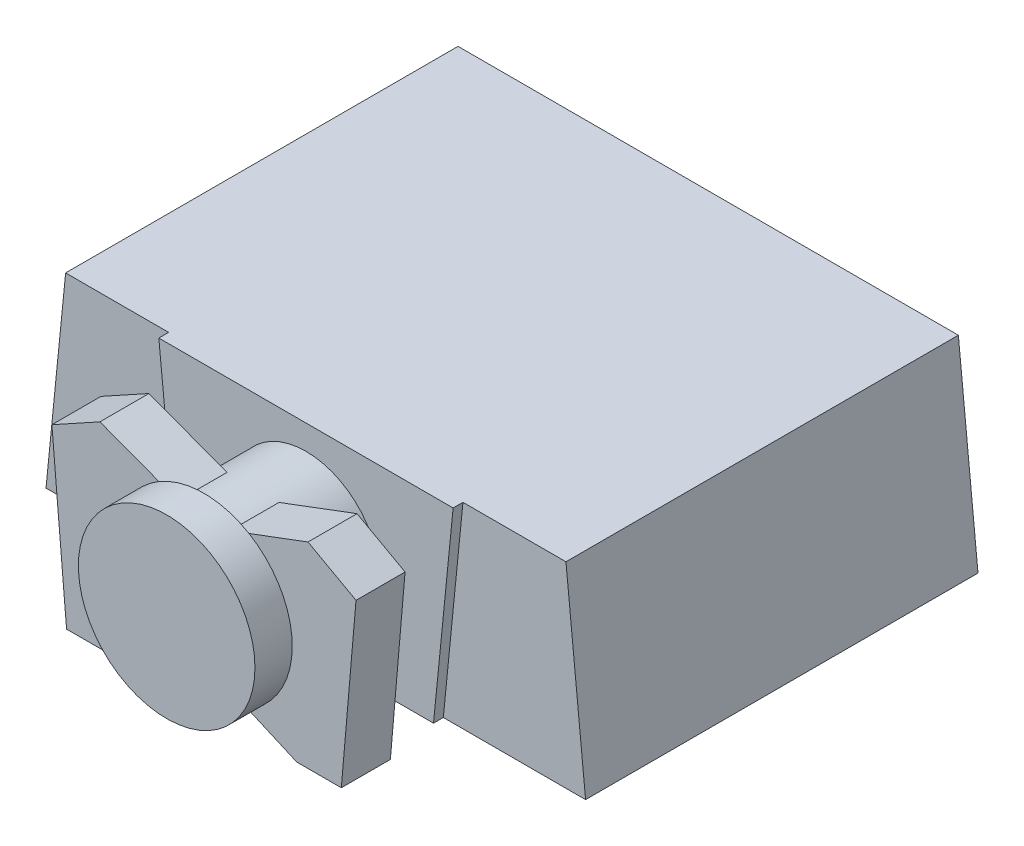
ISO-10303-21;
HEADER;
FILE_DESCRIPTION(('STEP AP214'),'2;1');
FILE_NAME('part.step','',(''),(''),'','','');
FILE_SCHEMA(('AUTOMOTIVE_DESIGN { 1 0 10303 214 1 1 1 1 }'));
ENDSEC;
DATA;
#1=APPLICATION_CONTEXT('core data for automotive mechanical design processes');
#2=APPLICATION_PROTOCOL_DEFINITION('international standard','automotive_design',2000,#1);
#3=PRODUCT_CONTEXT('',#1,'mechanical');
#4=PRODUCT('Part','Part','',(#3));
#5=PRODUCT_RELATED_PRODUCT_CATEGORY('part','',(#4));
#6=PRODUCT_DEFINITION_FORMATION('','',#4);
#7=PRODUCT_DEFINITION_CONTEXT('part definition',#1,'design');
#8=PRODUCT_DEFINITION('design','',#6,#7);
#9=PRODUCT_DEFINITION_SHAPE('','',#8);
#10=(LENGTH_UNIT() NAMED_UNIT(*) SI_UNIT(.MILLI.,.METRE.));
#11=(NAMED_UNIT(*) PLANE_ANGLE_UNIT() SI_UNIT($,.RADIAN.));
#12=(NAMED_UNIT(*) SI_UNIT($,.STERADIAN.) SOLID_ANGLE_UNIT());
#13=UNCERTAINTY_MEASURE_WITH_UNIT(LENGTH_MEASURE(1.E-05),#10,'distance_accuracy_value','');
#14=(GEOMETRIC_REPRESENTATION_CONTEXT(3) GLOBAL_UNCERTAINTY_ASSIGNED_CONTEXT((#13)) GLOBAL_UNIT_ASSIGNED_CONTEXT((#10,
#11,#12)) REPRESENTATION_CONTEXT('',''));
#15=CARTESIAN_POINT('',(0.,0.,0.));
#16=DIRECTION('',(0.,0.,1.));
#17=DIRECTION('',(1.,0.,0.));
#18=AXIS2_PLACEMENT_3D('',#15,#16,#17);
#19=CARTESIAN_POINT('',(0.,0.,57.));
#20=DIRECTION('',(0.,0.,1.));
#21=DIRECTION('',(1.,0.,0.));
#22=AXIS2_PLACEMENT_3D('',#19,#20,#21);
#23=PLANE('',#22);
#24=CARTESIAN_POINT('',(0.,0.,57.));
#25=DIRECTION('',(0.,0.,1.));
#26=DIRECTION('',(1.,0.,0.));
#27=AXIS2_PLACEMENT_3D('',#24,#25,#26);
#28=CIRCLE('',#27,45.);
#29=CARTESIAN_POINT('',(-22.9458905748051,38.710284237255,57.));
#30=VERTEX_POINT('',#29);
#31=CARTESIAN_POINT('',(-22.3462395669349,-39.0595132741967,57.));
#32=VERTEX_POINT('',#31);
#33=EDGE_CURVE('E11',#30,#32,#28,.T.);
#34=ORIENTED_EDGE('',*,*,#33,.F.);
#35=DIRECTION('',(-0.936220665654062,0.351412670804947,0.));
#36=VECTOR('',#35,1.);
#37=CARTESIAN_POINT('',(9.90206806938473,26.3807242295394,57.));
#38=LINE('',#37,#36);
#39=CARTESIAN_POINT('',(-53.0235345659322,50.,57.));
#40=VERTEX_POINT('',#39);
#41=EDGE_CURVE('E265',#30,#40,#38,.T.);
#42=ORIENTED_EDGE('',*,*,#41,.T.);
#43=DIRECTION('',(-0.875522034199031,-0.483178194491423,0.));
#44=VECTOR('',#43,1.);
#45=CARTESIAN_POINT('',(-33.5305940778251,60.7576547733478,57.));
#46=LINE('',#45,#44);
#47=CARTESIAN_POINT('',(-77.5,36.4920654032607,57.));
#48=VERTEX_POINT('',#47);
#49=EDGE_CURVE('E264',#40,#48,#46,.T.);
#50=ORIENTED_EDGE('',*,*,#49,.T.);
#51=DIRECTION('',(0.0862102539892259,-0.996276965560839,0.));
#52=VECTOR('',#51,1.);
#53=CARTESIAN_POINT('',(-73.7897262912551,-6.38520337743982,57.));
#54=LINE('',#53,#52);
#55=CARTESIAN_POINT('',(-70.0156325156325,-50.,57.));
#56=VERTEX_POINT('',#55);
#57=EDGE_CURVE('E268',#48,#56,#54,.T.);
#58=ORIENTED_EDGE('',*,*,#57,.T.);
#59=DIRECTION('',(-1.,0.,0.));
#60=VECTOR('',#59,1.);
#61=CARTESIAN_POINT('',(0.,-50.,57.));
#62=LINE('',#61,#60);
#63=CARTESIAN_POINT('',(-47.2912605588044,-50.,57.));
#64=VERTEX_POINT('',#63);
#65=EDGE_CURVE('E235',#64,#56,#62,.T.);
#66=ORIENTED_EDGE('',*,*,#65,.F.);
#67=DIRECTION('',(0.915792421439861,0.401651890115453,0.));
#68=VECTOR('',#67,1.);
#69=CARTESIAN_POINT('',(10.7622611435367,-24.5386550775961,57.));
#70=LINE('',#69,#68);
#71=EDGE_CURVE('E241',#64,#32,#70,.T.);
#72=ORIENTED_EDGE('',*,*,#71,.T.);
#73=EDGE_LOOP('',(#34,#42,#50,#58,#66,#72));
#74=FACE_BOUND('',#73,.T.);
#75=ADVANCED_FACE('F43',(#74),#23,.T.);
#76=CARTESIAN_POINT('',(0.,0.,0.));
#77=DIRECTION('',(0.,0.,1.));
#78=DIRECTION('',(1.,0.,0.));
#79=AXIS2_PLACEMENT_3D('',#76,#77,#78);
#80=PLANE('',#79);
#81=DIRECTION('',(1.,0.,0.));
#82=VECTOR('',#81,1.);
#83=CARTESIAN_POINT('',(0.,50.,0.));
#84=LINE('',#83,#82);
#85=CARTESIAN_POINT('',(75.,50.,0.));
#86=VERTEX_POINT('',#85);
#87=CARTESIAN_POINT('',(127.5,50.,0.));
#88=VERTEX_POINT('',#87);
#89=EDGE_CURVE('E415',#86,#88,#84,.T.);
#90=ORIENTED_EDGE('',*,*,#89,.F.);
#91=DIRECTION('',(-0.0995037190209989,-0.995037190209989,0.));
#92=VECTOR('',#91,1.);
#93=CARTESIAN_POINT('',(75.,50.,0.));
#94=LINE('',#93,#92);
#95=CARTESIAN_POINT('',(65.,-50.,0.));
#96=VERTEX_POINT('',#95);
#97=EDGE_CURVE('E373',#86,#96,#94,.T.);
#98=ORIENTED_EDGE('',*,*,#97,.T.);
#99=DIRECTION('',(1.,0.,0.));
#100=VECTOR('',#99,1.);
#101=CARTESIAN_POINT('',(0.,-50.,0.));
#102=LINE('',#101,#100);
#103=CARTESIAN_POINT('',(137.5,-50.,0.));
#104=VERTEX_POINT('',#103);
#105=EDGE_CURVE('E383',#96,#104,#102,.T.);
#106=ORIENTED_EDGE('',*,*,#105,.T.);
#107=DIRECTION('',(-0.0995037190209993,0.995037190209989,0.));
#108=VECTOR('',#107,1.);
#109=CARTESIAN_POINT('',(131.188118811881,13.1188118811882,0.));
#110=LINE('',#109,#108);
#111=EDGE_CURVE('E411',#104,#88,#110,.T.);
#112=ORIENTED_EDGE('',*,*,#111,.T.);
#113=EDGE_LOOP('',(#90,#98,#106,#112));
#114=FACE_BOUND('',#113,.T.);
#115=ADVANCED_FACE('F443',(#114),#80,.T.);
#116=CARTESIAN_POINT('',(-137.5,-50.0000000000001,0.));
#117=VERTEX_POINT('',#116);
#118=CARTESIAN_POINT('',(-65.,-50.,0.));
#119=VERTEX_POINT('',#118);
#120=EDGE_CURVE('E407',#117,#119,#102,.T.);
#121=ORIENTED_EDGE('',*,*,#120,.T.);
#122=DIRECTION('',(-0.0995037190209986,0.995037190209989,0.));
#123=VECTOR('',#122,1.);
#124=CARTESIAN_POINT('',(-75.,50.0000000000001,0.));
#125=LINE('',#124,#123);
#126=CARTESIAN_POINT('',(-75.,50.,0.));
#127=VERTEX_POINT('',#126);
#128=EDGE_CURVE('E360',#119,#127,#125,.T.);
#129=ORIENTED_EDGE('',*,*,#128,.T.);
#130=CARTESIAN_POINT('',(-127.5,50.,0.));
#131=VERTEX_POINT('',#130);
#132=EDGE_CURVE('E416',#131,#127,#84,.T.);
#133=ORIENTED_EDGE('',*,*,#132,.F.);
#134=DIRECTION('',(0.0995037190209987,0.995037190209989,0.));
#135=VECTOR('',#134,1.);
#136=CARTESIAN_POINT('',(-131.188118811881,13.1188118811881,0.));
#137=LINE('',#136,#135);
#138=EDGE_CURVE('E397',#117,#131,#137,.T.);
#139=ORIENTED_EDGE('',*,*,#138,.F.);
#140=EDGE_LOOP('',(#121,#129,#133,#139));
#141=FACE_BOUND('',#140,.T.);
#142=ADVANCED_FACE('F506',(#141),#80,.T.);
#143=CARTESIAN_POINT('',(0.,-50.,-200.));
#144=DIRECTION('',(0.,-1.,0.));
#145=DIRECTION('',(1.,0.,0.));
#146=AXIS2_PLACEMENT_3D('',#143,#144,#145);
#147=PLANE('',#146);
#148=ORIENTED_EDGE('',*,*,#120,.F.);
#149=DIRECTION('',(0.,0.,1.));
#150=VECTOR('',#149,1.);
#151=CARTESIAN_POINT('',(-137.5,-50.0000000000001,-200.));
#152=LINE('',#151,#150);
#153=CARTESIAN_POINT('',(-137.5,-50.0000000000001,-200.));
#154=VERTEX_POINT('',#153);
#155=EDGE_CURVE('E354',#154,#117,#152,.T.);
#156=ORIENTED_EDGE('',*,*,#155,.F.);
#157=DIRECTION('',(1.,0.,0.));
#158=VECTOR('',#157,1.);
#159=CARTESIAN_POINT('',(0.,-50.,-200.));
#160=LINE('',#159,#158);
#161=CARTESIAN_POINT('',(137.5,-50.,-200.));
#162=VERTEX_POINT('',#161);
#163=EDGE_CURVE('E392',#154,#162,#160,.T.);
#164=ORIENTED_EDGE('',*,*,#163,.T.);
#165=DIRECTION('',(0.,0.,1.));
#166=VECTOR('',#165,1.);
#167=CARTESIAN_POINT('',(137.5,-50.,-200.));
#168=LINE('',#167,#166);
#169=EDGE_CURVE('E47',#162,#104,#168,.T.);
#170=ORIENTED_EDGE('',*,*,#169,.T.);
#171=ORIENTED_EDGE('',*,*,#105,.F.);
#172=DIRECTION('',(0.,0.,-1.));
#173=VECTOR('',#172,1.);
#174=CARTESIAN_POINT('',(65.,-50.,5.));
#175=LINE('',#174,#173);
#176=CARTESIAN_POINT('',(65.,-50.,5.));
#177=VERTEX_POINT('',#176);
#178=EDGE_CURVE('E387',#177,#96,#175,.T.);
#179=ORIENTED_EDGE('',*,*,#178,.F.);
#180=DIRECTION('',(-1.,0.,0.));
#181=VECTOR('',#180,1.);
#182=CARTESIAN_POINT('',(65.,-50.,5.));
#183=LINE('',#182,#181);
#184=CARTESIAN_POINT('',(-65.,-50.,5.));
#185=VERTEX_POINT('',#184);
#186=EDGE_CURVE('E364',#177,#185,#183,.T.);
#187=ORIENTED_EDGE('',*,*,#186,.T.);
#188=DIRECTION('',(0.,0.,-1.));
#189=VECTOR('',#188,1.);
#190=CARTESIAN_POINT('',(-65.,-50.,5.));
#191=LINE('',#190,#189);
#192=EDGE_CURVE('E384',#185,#119,#191,.T.);
#193=ORIENTED_EDGE('',*,*,#192,.T.);
#194=EDGE_LOOP('',(#148,#156,#164,#170,#171,#179,#187,#193));
#195=FACE_BOUND('',#194,.T.);
#196=ADVANCED_FACE('F45',(#195),#147,.T.);
#197=CARTESIAN_POINT('',(-131.188118811881,13.1188118811881,-200.));
#198=DIRECTION('',(0.995037190209989,-0.0995037190209987,0.));
#199=DIRECTION('',(0.0995037190209987,0.995037190209989,0.));
#200=AXIS2_PLACEMENT_3D('',#197,#198,#199);
#201=PLANE('',#200);
#202=ORIENTED_EDGE('',*,*,#138,.T.);
#203=DIRECTION('',(0.,0.,1.));
#204=VECTOR('',#203,1.);
#205=CARTESIAN_POINT('',(-127.5,50.,-200.));
#206=LINE('',#205,#204);
#207=CARTESIAN_POINT('',(-127.5,50.,-200.));
#208=VERTEX_POINT('',#207);
#209=EDGE_CURVE('E424',#208,#131,#206,.T.);
#210=ORIENTED_EDGE('',*,*,#209,.F.);
#211=DIRECTION('',(0.0995037190209987,0.995037190209989,0.));
#212=VECTOR('',#211,1.);
#213=CARTESIAN_POINT('',(-131.188118811881,13.1188118811881,-200.));
#214=LINE('',#213,#212);
#215=EDGE_CURVE('E404',#154,#208,#214,.T.);
#216=ORIENTED_EDGE('',*,*,#215,.F.);
#217=ORIENTED_EDGE('',*,*,#155,.T.);
#218=EDGE_LOOP('',(#202,#210,#216,#217));
#219=FACE_BOUND('',#218,.T.);
#220=ADVANCED_FACE('F664',(#219),#201,.F.);
#221=CARTESIAN_POINT('',(0.,50.,-200.));
#222=DIRECTION('',(0.,-1.,0.));
#223=DIRECTION('',(1.,0.,0.));
#224=AXIS2_PLACEMENT_3D('',#221,#222,#223);
#225=PLANE('',#224);
#226=ORIENTED_EDGE('',*,*,#132,.T.);
#227=DIRECTION('',(0.,0.,-1.));
#228=VECTOR('',#227,1.);
#229=CARTESIAN_POINT('',(-75.,50.0000000000001,5.));
#230=LINE('',#229,#228);
#231=CARTESIAN_POINT('',(-75.,50.0000000000001,5.));
#232=VERTEX_POINT('',#231);
#233=EDGE_CURVE('E380',#232,#127,#230,.T.);
#234=ORIENTED_EDGE('',*,*,#233,.F.);
#235=DIRECTION('',(1.,0.,0.));
#236=VECTOR('',#235,1.);
#237=CARTESIAN_POINT('',(75.,50.,5.));
#238=LINE('',#237,#236);
#239=CARTESIAN_POINT('',(75.,50.,5.));
#240=VERTEX_POINT('',#239);
#241=EDGE_CURVE('E355',#232,#240,#238,.T.);
#242=ORIENTED_EDGE('',*,*,#241,.T.);
#243=DIRECTION('',(0.,0.,-1.));
#244=VECTOR('',#243,1.);
#245=CARTESIAN_POINT('',(75.,50.,5.));
#246=LINE('',#245,#244);
#247=EDGE_CURVE('E372',#240,#86,#246,.T.);
#248=ORIENTED_EDGE('',*,*,#247,.T.);
#249=ORIENTED_EDGE('',*,*,#89,.T.);
#250=DIRECTION('',(0.,0.,1.));
#251=VECTOR('',#250,1.);
#252=CARTESIAN_POINT('',(127.5,50.,-200.));
#253=LINE('',#252,#251);
#254=CARTESIAN_POINT('',(127.5,50.,-200.));
#255=VERTEX_POINT('',#254);
#256=EDGE_CURVE('E427',#255,#88,#253,.T.);
#257=ORIENTED_EDGE('',*,*,#256,.F.);
#258=DIRECTION('',(1.,0.,0.));
#259=VECTOR('',#258,1.);
#260=CARTESIAN_POINT('',(0.,50.,-200.));
#261=LINE('',#260,#259);
#262=EDGE_CURVE('E401',#208,#255,#261,.T.);
#263=ORIENTED_EDGE('',*,*,#262,.F.);
#264=ORIENTED_EDGE('',*,*,#209,.T.);
#265=EDGE_LOOP('',(#226,#234,#242,#248,#249,#257,#263,#264));
#266=FACE_BOUND('',#265,.T.);
#267=ADVANCED_FACE('F660',(#266),#225,.F.);
#268=CARTESIAN_POINT('',(131.188118811881,13.1188118811882,-200.));
#269=DIRECTION('',(0.995037190209989,0.0995037190209992,0.));
#270=DIRECTION('',(-0.0995037190209992,0.995037190209989,0.));
#271=AXIS2_PLACEMENT_3D('',#268,#269,#270);
#272=PLANE('',#271);
#273=ORIENTED_EDGE('',*,*,#111,.F.);
#274=ORIENTED_EDGE('',*,*,#169,.F.);
#275=DIRECTION('',(-0.0995037190209993,0.995037190209989,0.));
#276=VECTOR('',#275,1.);
#277=CARTESIAN_POINT('',(131.188118811881,13.1188118811882,-200.));
#278=LINE('',#277,#276);
#279=EDGE_CURVE('E396',#162,#255,#278,.T.);
#280=ORIENTED_EDGE('',*,*,#279,.T.);
#281=ORIENTED_EDGE('',*,*,#256,.T.);
#282=EDGE_LOOP('',(#273,#274,#280,#281));
#283=FACE_BOUND('',#282,.T.);
#284=ADVANCED_FACE('F440',(#283),#272,.T.);
#285=CARTESIAN_POINT('',(0.,0.,-200.));
#286=DIRECTION('',(0.,0.,1.));
#287=DIRECTION('',(1.,0.,0.));
#288=AXIS2_PLACEMENT_3D('',#285,#286,#287);
#289=PLANE('',#288);
#290=ORIENTED_EDGE('',*,*,#163,.F.);
#291=ORIENTED_EDGE('',*,*,#215,.T.);
#292=ORIENTED_EDGE('',*,*,#262,.T.);
#293=ORIENTED_EDGE('',*,*,#279,.F.);
#294=EDGE_LOOP('',(#290,#291,#292,#293));
#295=FACE_BOUND('',#294,.T.);
#296=ADVANCED_FACE('F652',(#295),#289,.F.);
#297=CARTESIAN_POINT('',(-75.,50.0000000000001,5.));
#298=DIRECTION('',(-0.995037190209989,-0.0995037190209986,0.));
#299=DIRECTION('',(0.0995037190209986,-0.995037190209989,0.));
#300=AXIS2_PLACEMENT_3D('',#297,#298,#299);
#301=PLANE('',#300);
#302=ORIENTED_EDGE('',*,*,#128,.F.);
#303=ORIENTED_EDGE('',*,*,#192,.F.);
#304=DIRECTION('',(-0.0995037190209986,0.995037190209989,0.));
#305=VECTOR('',#304,1.);
#306=CARTESIAN_POINT('',(-75.,50.0000000000001,5.));
#307=LINE('',#306,#305);
#308=EDGE_CURVE('E368',#185,#232,#307,.T.);
#309=ORIENTED_EDGE('',*,*,#308,.T.);
#310=ORIENTED_EDGE('',*,*,#233,.T.);
#311=EDGE_LOOP('',(#302,#303,#309,#310));
#312=FACE_BOUND('',#311,.T.);
#313=ADVANCED_FACE('F642',(#312),#301,.T.);
#314=CARTESIAN_POINT('',(75.,50.,5.));
#315=DIRECTION('',(0.995037190209989,-0.0995037190209989,0.));
#316=DIRECTION('',(0.0995037190209989,0.995037190209989,0.));
#317=AXIS2_PLACEMENT_3D('',#314,#315,#316);
#318=PLANE('',#317);
#319=ORIENTED_EDGE('',*,*,#97,.F.);
#320=ORIENTED_EDGE('',*,*,#247,.F.);
#321=DIRECTION('',(-0.0995037190209989,-0.995037190209989,0.));
#322=VECTOR('',#321,1.);
#323=CARTESIAN_POINT('',(75.,50.,5.));
#324=LINE('',#323,#322);
#325=EDGE_CURVE('E359',#240,#177,#324,.T.);
#326=ORIENTED_EDGE('',*,*,#325,.T.);
#327=ORIENTED_EDGE('',*,*,#178,.T.);
#328=EDGE_LOOP('',(#319,#320,#326,#327));
#329=FACE_BOUND('',#328,.T.);
#330=ADVANCED_FACE('F631',(#329),#318,.T.);
#331=CARTESIAN_POINT('',(0.,0.,5.));
#332=DIRECTION('',(0.,0.,1.));
#333=DIRECTION('',(1.,0.,0.));
#334=AXIS2_PLACEMENT_3D('',#331,#332,#333);
#335=PLANE('',#334);
#336=CARTESIAN_POINT('',(0.,0.,5.));
#337=DIRECTION('',(0.,0.,1.));
#338=DIRECTION('',(1.,0.,0.));
#339=AXIS2_PLACEMENT_3D('',#336,#337,#338);
#340=CIRCLE('',#339,37.5);
#341=CARTESIAN_POINT('',(37.5,0.,5.));
#342=VERTEX_POINT('',#341);
#343=EDGE_CURVE('E222',#342,#342,#340,.T.);
#344=ORIENTED_EDGE('',*,*,#343,.F.);
#345=EDGE_LOOP('',(#344));
#346=FACE_BOUND('',#345,.T.);
#347=ORIENTED_EDGE('',*,*,#241,.F.);
#348=ORIENTED_EDGE('',*,*,#308,.F.);
#349=ORIENTED_EDGE('',*,*,#186,.F.);
#350=ORIENTED_EDGE('',*,*,#325,.F.);
#351=EDGE_LOOP('',(#347,#348,#349,#350));
#352=FACE_BOUND('',#351,.T.);
#353=ADVANCED_FACE('F558',(#346,#352),#335,.T.);
#354=CARTESIAN_POINT('',(0.,0.,32.));
#355=DIRECTION('',(0.,0.,-1.));
#356=DIRECTION('',(-1.,0.,0.));
#357=AXIS2_PLACEMENT_3D('',#354,#355,#356);
#358=CYLINDRICAL_SURFACE('',#357,37.5);
#359=CARTESIAN_POINT('',(0.,0.,32.));
#360=DIRECTION('',(0.,0.,1.));
#361=DIRECTION('',(1.,0.,0.));
#362=AXIS2_PLACEMENT_3D('',#359,#360,#361);
#363=CIRCLE('',#362,37.5);
#364=CARTESIAN_POINT('',(-13.2636039462143,35.0760147445226,32.));
#365=VERTEX_POINT('',#364);
#366=CARTESIAN_POINT('',(-13.2636039462143,-35.0760147445226,32.));
#367=VERTEX_POINT('',#366);
#368=EDGE_CURVE('E350',#365,#367,#363,.T.);
#369=ORIENTED_EDGE('',*,*,#368,.F.);
#370=DIRECTION('',(0.,0.,-1.));
#371=VECTOR('',#370,1.);
#372=CARTESIAN_POINT('',(-13.2636039462143,35.0760147445226,57.));
#373=LINE('',#372,#371);
#374=CARTESIAN_POINT('',(-13.2636039462143,35.0760147445226,57.));
#375=VERTEX_POINT('',#374);
#376=EDGE_CURVE('E318',#375,#365,#373,.T.);
#377=ORIENTED_EDGE('',*,*,#376,.F.);
#378=CARTESIAN_POINT('',(0.,0.,57.));
#379=DIRECTION('',(0.,0.,1.));
#380=DIRECTION('',(1.,0.,0.));
#381=AXIS2_PLACEMENT_3D('',#378,#379,#380);
#382=CIRCLE('',#381,37.5);
#383=CARTESIAN_POINT('',(13.2636039462143,35.0760147445226,57.));
#384=VERTEX_POINT('',#383);
#385=EDGE_CURVE('E207',#384,#375,#382,.T.);
#386=ORIENTED_EDGE('',*,*,#385,.F.);
#387=DIRECTION('',(0.,0.,-1.));
#388=VECTOR('',#387,1.);
#389=CARTESIAN_POINT('',(13.2636039462143,35.0760147445226,57.));
#390=LINE('',#389,#388);
#391=CARTESIAN_POINT('',(13.2636039462143,35.0760147445226,32.));
#392=VERTEX_POINT('',#391);
#393=EDGE_CURVE('E201',#384,#392,#390,.T.);
#394=ORIENTED_EDGE('',*,*,#393,.T.);
#395=CARTESIAN_POINT('',(13.2636039462144,-35.0760147445226,32.));
#396=VERTEX_POINT('',#395);
#397=EDGE_CURVE('E347',#396,#392,#363,.T.);
#398=ORIENTED_EDGE('',*,*,#397,.F.);
#399=DIRECTION('',(0.,0.,-1.));
#400=VECTOR('',#399,1.);
#401=CARTESIAN_POINT('',(13.2636039462144,-35.0760147445226,57.));
#402=LINE('',#401,#400);
#403=CARTESIAN_POINT('',(13.2636039462144,-35.0760147445226,57.));
#404=VERTEX_POINT('',#403);
#405=EDGE_CURVE('E336',#404,#396,#402,.T.);
#406=ORIENTED_EDGE('',*,*,#405,.F.);
#407=CARTESIAN_POINT('',(-13.2636039462143,-35.0760147445226,57.));
#408=VERTEX_POINT('',#407);
#409=EDGE_CURVE('E244',#408,#404,#382,.T.);
#410=ORIENTED_EDGE('',*,*,#409,.F.);
#411=DIRECTION('',(0.,0.,-1.));
#412=VECTOR('',#411,1.);
#413=CARTESIAN_POINT('',(-13.2636039462143,-35.0760147445226,57.));
#414=LINE('',#413,#412);
#415=EDGE_CURVE('E340',#408,#367,#414,.T.);
#416=ORIENTED_EDGE('',*,*,#415,.T.);
#417=EDGE_LOOP('',(#369,#377,#386,#394,#398,#406,#410,#416));
#418=FACE_BOUND('',#417,.T.);
#419=ORIENTED_EDGE('',*,*,#343,.T.);
#420=EDGE_LOOP('',(#419));
#421=FACE_BOUND('',#420,.T.);
#422=ADVANCED_FACE('F472',(#418,#421),#358,.T.);
#423=CARTESIAN_POINT('',(0.,0.,32.));
#424=DIRECTION('',(0.,0.,1.));
#425=DIRECTION('',(1.,0.,0.));
#426=AXIS2_PLACEMENT_3D('',#423,#424,#425);
#427=PLANE('',#426);
#428=DIRECTION('',(-0.936220665654062,0.351412670804947,0.));
#429=VECTOR('',#428,1.);
#430=CARTESIAN_POINT('',(9.90206806938473,26.3807242295394,32.));
#431=LINE('',#430,#429);
#432=CARTESIAN_POINT('',(-53.0235345659322,50.,32.));
#433=VERTEX_POINT('',#432);
#434=EDGE_CURVE('E299',#365,#433,#431,.T.);
#435=ORIENTED_EDGE('',*,*,#434,.F.);
#436=ORIENTED_EDGE('',*,*,#368,.T.);
#437=DIRECTION('',(0.915792421439861,0.401651890115453,0.));
#438=VECTOR('',#437,1.);
#439=CARTESIAN_POINT('',(10.7622611435367,-24.5386550775961,32.));
#440=LINE('',#439,#438);
#441=CARTESIAN_POINT('',(-47.2912605588044,-50.,32.));
#442=VERTEX_POINT('',#441);
#443=EDGE_CURVE('E275',#442,#367,#440,.T.);
#444=ORIENTED_EDGE('',*,*,#443,.F.);
#445=DIRECTION('',(-1.,0.,0.));
#446=VECTOR('',#445,1.);
#447=CARTESIAN_POINT('',(0.,-50.,32.));
#448=LINE('',#447,#446);
#449=CARTESIAN_POINT('',(-70.0156325156325,-50.,32.));
#450=VERTEX_POINT('',#449);
#451=EDGE_CURVE('E232',#442,#450,#448,.T.);
#452=ORIENTED_EDGE('',*,*,#451,.T.);
#453=DIRECTION('',(0.0862102539892259,-0.996276965560839,0.));
#454=VECTOR('',#453,1.);
#455=CARTESIAN_POINT('',(-73.7897262912551,-6.38520337743982,32.));
#456=LINE('',#455,#454);
#457=CARTESIAN_POINT('',(-77.5,36.4920654032607,32.));
#458=VERTEX_POINT('',#457);
#459=EDGE_CURVE('E240',#458,#450,#456,.T.);
#460=ORIENTED_EDGE('',*,*,#459,.F.);
#461=DIRECTION('',(-0.875522034199031,-0.483178194491423,0.));
#462=VECTOR('',#461,1.);
#463=CARTESIAN_POINT('',(-33.5305940778251,60.7576547733478,32.));
#464=LINE('',#463,#462);
#465=EDGE_CURVE('E302',#433,#458,#464,.T.);
#466=ORIENTED_EDGE('',*,*,#465,.F.);
#467=EDGE_LOOP('',(#435,#436,#444,#452,#460,#466));
#468=FACE_BOUND('',#467,.T.);
#469=ADVANCED_FACE('F468',(#468),#427,.F.);
#470=DIRECTION('',(-0.915792421439861,0.401651890115453,0.));
#471=VECTOR('',#470,1.);
#472=CARTESIAN_POINT('',(-10.7622611435367,-24.538655077596,32.));
#473=LINE('',#472,#471);
#474=CARTESIAN_POINT('',(47.2912605588045,-50.,32.));
#475=VERTEX_POINT('',#474);
#476=EDGE_CURVE('E279',#475,#396,#473,.T.);
#477=ORIENTED_EDGE('',*,*,#476,.T.);
#478=ORIENTED_EDGE('',*,*,#397,.T.);
#479=DIRECTION('',(0.936220665654062,0.351412670804947,0.));
#480=VECTOR('',#479,1.);
#481=CARTESIAN_POINT('',(-9.90206806938473,26.3807242295394,32.));
#482=LINE('',#481,#480);
#483=CARTESIAN_POINT('',(53.0235345659322,50.,32.));
#484=VERTEX_POINT('',#483);
#485=EDGE_CURVE('E295',#392,#484,#482,.T.);
#486=ORIENTED_EDGE('',*,*,#485,.T.);
#487=DIRECTION('',(0.875522034199031,-0.483178194491423,0.));
#488=VECTOR('',#487,1.);
#489=CARTESIAN_POINT('',(33.530594077825,60.7576547733478,32.));
#490=LINE('',#489,#488);
#491=CARTESIAN_POINT('',(77.5,36.4920654032607,32.));
#492=VERTEX_POINT('',#491);
#493=EDGE_CURVE('E291',#484,#492,#490,.T.);
#494=ORIENTED_EDGE('',*,*,#493,.T.);
#495=DIRECTION('',(-0.0862102539892256,-0.996276965560839,0.));
#496=VECTOR('',#495,1.);
#497=CARTESIAN_POINT('',(73.7897262912551,-6.3852033774398,32.));
#498=LINE('',#497,#496);
#499=CARTESIAN_POINT('',(70.0156325156325,-50.,32.));
#500=VERTEX_POINT('',#499);
#501=EDGE_CURVE('E287',#492,#500,#498,.T.);
#502=ORIENTED_EDGE('',*,*,#501,.T.);
#503=DIRECTION('',(-1.,0.,0.));
#504=VECTOR('',#503,1.);
#505=CARTESIAN_POINT('',(0.,-50.,32.));
#506=LINE('',#505,#504);
#507=EDGE_CURVE('E283',#500,#475,#506,.T.);
#508=ORIENTED_EDGE('',*,*,#507,.T.);
#509=EDGE_LOOP('',(#477,#478,#486,#494,#502,#508));
#510=FACE_BOUND('',#509,.T.);
#511=ADVANCED_FACE('F480',(#510),#427,.F.);
#512=CARTESIAN_POINT('',(0.,-50.,57.));
#513=DIRECTION('',(0.,-1.,0.));
#514=DIRECTION('',(1.,0.,0.));
#515=AXIS2_PLACEMENT_3D('',#512,#513,#514);
#516=PLANE('',#515);
#517=ORIENTED_EDGE('',*,*,#451,.F.);
#518=DIRECTION('',(0.,0.,-1.));
#519=VECTOR('',#518,1.);
#520=CARTESIAN_POINT('',(-47.2912605588044,-50.,57.));
#521=LINE('',#520,#519);
#522=EDGE_CURVE('E344',#64,#442,#521,.T.);
#523=ORIENTED_EDGE('',*,*,#522,.F.);
#524=ORIENTED_EDGE('',*,*,#65,.T.);
#525=DIRECTION('',(0.,0.,-1.));
#526=VECTOR('',#525,1.);
#527=CARTESIAN_POINT('',(-70.0156325156325,-50.,57.));
#528=LINE('',#527,#526);
#529=EDGE_CURVE('E271',#56,#450,#528,.T.);
#530=ORIENTED_EDGE('',*,*,#529,.T.);
#531=EDGE_LOOP('',(#517,#523,#524,#530));
#532=FACE_BOUND('',#531,.T.);
#533=ADVANCED_FACE('F464',(#532),#516,.T.);
#534=CARTESIAN_POINT('',(10.7622611435367,-24.5386550775961,57.));
#535=DIRECTION('',(-0.401651890115453,0.915792421439861,0.));
#536=DIRECTION('',(-0.915792421439861,-0.401651890115453,0.));
#537=AXIS2_PLACEMENT_3D('',#534,#535,#536);
#538=PLANE('',#537);
#539=ORIENTED_EDGE('',*,*,#443,.T.);
#540=ORIENTED_EDGE('',*,*,#415,.F.);
#541=EDGE_CURVE('E239',#32,#408,#70,.T.);
#542=ORIENTED_EDGE('',*,*,#541,.F.);
#543=ORIENTED_EDGE('',*,*,#71,.F.);
#544=ORIENTED_EDGE('',*,*,#522,.T.);
#545=EDGE_LOOP('',(#539,#540,#542,#543,#544));
#546=FACE_BOUND('',#545,.T.);
#547=ADVANCED_FACE('F458',(#546),#538,.F.);
#548=CARTESIAN_POINT('',(-10.7622611435367,-24.538655077596,57.));
#549=DIRECTION('',(-0.401651890115453,-0.915792421439861,0.));
#550=DIRECTION('',(0.915792421439861,-0.401651890115453,0.));
#551=AXIS2_PLACEMENT_3D('',#548,#549,#550);
#552=PLANE('',#551);
#553=ORIENTED_EDGE('',*,*,#476,.F.);
#554=DIRECTION('',(0.,0.,-1.));
#555=VECTOR('',#554,1.);
#556=CARTESIAN_POINT('',(47.2912605588045,-50.,57.));
#557=LINE('',#556,#555);
#558=CARTESIAN_POINT('',(47.2912605588045,-50.,57.));
#559=VERTEX_POINT('',#558);
#560=EDGE_CURVE('E333',#559,#475,#557,.T.);
#561=ORIENTED_EDGE('',*,*,#560,.F.);
#562=DIRECTION('',(-0.915792421439861,0.401651890115453,0.));
#563=VECTOR('',#562,1.);
#564=CARTESIAN_POINT('',(-10.7622611435367,-24.538655077596,57.));
#565=LINE('',#564,#563);
#566=CARTESIAN_POINT('',(22.346239566935,-39.0595132741967,57.));
#567=VERTEX_POINT('',#566);
#568=EDGE_CURVE('E249',#559,#567,#565,.T.);
#569=ORIENTED_EDGE('',*,*,#568,.T.);
#570=EDGE_CURVE('E248',#567,#404,#565,.T.);
#571=ORIENTED_EDGE('',*,*,#570,.T.);
#572=ORIENTED_EDGE('',*,*,#405,.T.);
#573=EDGE_LOOP('',(#553,#561,#569,#571,#572));
#574=FACE_BOUND('',#573,.T.);
#575=ADVANCED_FACE('F484',(#574),#552,.T.);
#576=CARTESIAN_POINT('',(0.,-50.,57.));
#577=DIRECTION('',(0.,-1.,0.));
#578=DIRECTION('',(1.,0.,0.));
#579=AXIS2_PLACEMENT_3D('',#576,#577,#578);
#580=PLANE('',#579);
#581=ORIENTED_EDGE('',*,*,#507,.F.);
#582=DIRECTION('',(0.,0.,-1.));
#583=VECTOR('',#582,1.);
#584=CARTESIAN_POINT('',(70.0156325156325,-50.,57.));
#585=LINE('',#584,#583);
#586=CARTESIAN_POINT('',(70.0156325156325,-50.,57.));
#587=VERTEX_POINT('',#586);
#588=EDGE_CURVE('E330',#587,#500,#585,.T.);
#589=ORIENTED_EDGE('',*,*,#588,.F.);
#590=DIRECTION('',(-1.,0.,0.));
#591=VECTOR('',#590,1.);
#592=CARTESIAN_POINT('',(0.,-50.,57.));
#593=LINE('',#592,#591);
#594=EDGE_CURVE('E252',#587,#559,#593,.T.);
#595=ORIENTED_EDGE('',*,*,#594,.T.);
#596=ORIENTED_EDGE('',*,*,#560,.T.);
#597=EDGE_LOOP('',(#581,#589,#595,#596));
#598=FACE_BOUND('',#597,.T.);
#599=ADVANCED_FACE('F487',(#598),#580,.T.);
#600=CARTESIAN_POINT('',(73.7897262912551,-6.3852033774398,57.));
#601=DIRECTION('',(0.996276965560839,-0.0862102539892256,0.));
#602=DIRECTION('',(0.0862102539892256,0.996276965560839,0.));
#603=AXIS2_PLACEMENT_3D('',#600,#601,#602);
#604=PLANE('',#603);
#605=ORIENTED_EDGE('',*,*,#501,.F.);
#606=DIRECTION('',(0.,0.,-1.));
#607=VECTOR('',#606,1.);
#608=CARTESIAN_POINT('',(77.5,36.4920654032607,57.));
#609=LINE('',#608,#607);
#610=CARTESIAN_POINT('',(77.5,36.4920654032607,57.));
#611=VERTEX_POINT('',#610);
#612=EDGE_CURVE('E327',#611,#492,#609,.T.);
#613=ORIENTED_EDGE('',*,*,#612,.F.);
#614=DIRECTION('',(-0.0862102539892256,-0.996276965560839,0.));
#615=VECTOR('',#614,1.);
#616=CARTESIAN_POINT('',(73.7897262912551,-6.3852033774398,57.));
#617=LINE('',#616,#615);
#618=EDGE_CURVE('E256',#611,#587,#617,.T.);
#619=ORIENTED_EDGE('',*,*,#618,.T.);
#620=ORIENTED_EDGE('',*,*,#588,.T.);
#621=EDGE_LOOP('',(#605,#613,#619,#620));
#622=FACE_BOUND('',#621,.T.);
#623=ADVANCED_FACE('F490',(#622),#604,.T.);
#624=CARTESIAN_POINT('',(33.530594077825,60.7576547733478,57.));
#625=DIRECTION('',(0.483178194491423,0.875522034199031,0.));
#626=DIRECTION('',(-0.875522034199031,0.483178194491423,0.));
#627=AXIS2_PLACEMENT_3D('',#624,#625,#626);
#628=PLANE('',#627);
#629=ORIENTED_EDGE('',*,*,#493,.F.);
#630=DIRECTION('',(0.,0.,-1.));
#631=VECTOR('',#630,1.);
#632=CARTESIAN_POINT('',(53.0235345659322,50.,57.));
#633=LINE('',#632,#631);
#634=CARTESIAN_POINT('',(53.0235345659322,50.,57.));
#635=VERTEX_POINT('',#634);
#636=EDGE_CURVE('E324',#635,#484,#633,.T.);
#637=ORIENTED_EDGE('',*,*,#636,.F.);
#638=DIRECTION('',(0.875522034199031,-0.483178194491423,0.));
#639=VECTOR('',#638,1.);
#640=CARTESIAN_POINT('',(33.530594077825,60.7576547733478,57.));
#641=LINE('',#640,#639);
#642=EDGE_CURVE('E213',#635,#611,#641,.T.);
#643=ORIENTED_EDGE('',*,*,#642,.T.);
#644=ORIENTED_EDGE('',*,*,#612,.T.);
#645=EDGE_LOOP('',(#629,#637,#643,#644));
#646=FACE_BOUND('',#645,.T.);
#647=ADVANCED_FACE('F492',(#646),#628,.T.);
#648=CARTESIAN_POINT('',(-9.90206806938473,26.3807242295394,57.));
#649=DIRECTION('',(-0.351412670804947,0.936220665654062,0.));
#650=DIRECTION('',(-0.936220665654062,-0.351412670804947,0.));
#651=AXIS2_PLACEMENT_3D('',#648,#649,#650);
#652=PLANE('',#651);
#653=ORIENTED_EDGE('',*,*,#485,.F.);
#654=ORIENTED_EDGE('',*,*,#393,.F.);
#655=DIRECTION('',(0.936220665654062,0.351412670804947,0.));
#656=VECTOR('',#655,1.);
#657=CARTESIAN_POINT('',(-9.90206806938473,26.3807242295394,57.));
#658=LINE('',#657,#656);
#659=CARTESIAN_POINT('',(22.9458905748051,38.710284237255,57.));
#660=VERTEX_POINT('',#659);
#661=EDGE_CURVE('E195',#384,#660,#658,.T.);
#662=ORIENTED_EDGE('',*,*,#661,.T.);
#663=EDGE_CURVE('E198',#660,#635,#658,.T.);
#664=ORIENTED_EDGE('',*,*,#663,.T.);
#665=ORIENTED_EDGE('',*,*,#636,.T.);
#666=EDGE_LOOP('',(#653,#654,#662,#664,#665));
#667=FACE_BOUND('',#666,.T.);
#668=ADVANCED_FACE('F197',(#667),#652,.T.);
#669=CARTESIAN_POINT('',(9.90206806938473,26.3807242295394,57.));
#670=DIRECTION('',(-0.351412670804947,-0.936220665654062,0.));
#671=DIRECTION('',(0.936220665654062,-0.351412670804947,0.));
#672=AXIS2_PLACEMENT_3D('',#669,#670,#671);
#673=PLANE('',#672);
#674=ORIENTED_EDGE('',*,*,#434,.T.);
#675=DIRECTION('',(0.,0.,-1.));
#676=VECTOR('',#675,1.);
#677=CARTESIAN_POINT('',(-53.0235345659322,50.,57.));
#678=LINE('',#677,#676);
#679=EDGE_CURVE('E314',#40,#433,#678,.T.);
#680=ORIENTED_EDGE('',*,*,#679,.F.);
#681=ORIENTED_EDGE('',*,*,#41,.F.);
#682=EDGE_CURVE('E226',#375,#30,#38,.T.);
#683=ORIENTED_EDGE('',*,*,#682,.F.);
#684=ORIENTED_EDGE('',*,*,#376,.T.);
#685=EDGE_LOOP('',(#674,#680,#681,#683,#684));
#686=FACE_BOUND('',#685,.T.);
#687=ADVANCED_FACE('F475',(#686),#673,.F.);
#688=CARTESIAN_POINT('',(-33.5305940778251,60.7576547733478,57.));
#689=DIRECTION('',(0.483178194491423,-0.875522034199031,0.));
#690=DIRECTION('',(0.875522034199031,0.483178194491423,0.));
#691=AXIS2_PLACEMENT_3D('',#688,#689,#690);
#692=PLANE('',#691);
#693=ORIENTED_EDGE('',*,*,#465,.T.);
#694=DIRECTION('',(0.,0.,-1.));
#695=VECTOR('',#694,1.);
#696=CARTESIAN_POINT('',(-77.5,36.4920654032607,57.));
#697=LINE('',#696,#695);
#698=EDGE_CURVE('E310',#48,#458,#697,.T.);
#699=ORIENTED_EDGE('',*,*,#698,.F.);
#700=ORIENTED_EDGE('',*,*,#49,.F.);
#701=ORIENTED_EDGE('',*,*,#679,.T.);
#702=EDGE_LOOP('',(#693,#699,#700,#701));
#703=FACE_BOUND('',#702,.T.);
#704=ADVANCED_FACE('F517',(#703),#692,.F.);
#705=CARTESIAN_POINT('',(-73.7897262912551,-6.38520337743982,57.));
#706=DIRECTION('',(0.996276965560839,0.0862102539892259,0.));
#707=DIRECTION('',(-0.0862102539892259,0.996276965560839,0.));
#708=AXIS2_PLACEMENT_3D('',#705,#706,#707);
#709=PLANE('',#708);
#710=ORIENTED_EDGE('',*,*,#459,.T.);
#711=ORIENTED_EDGE('',*,*,#529,.F.);
#712=ORIENTED_EDGE('',*,*,#57,.F.);
#713=ORIENTED_EDGE('',*,*,#698,.T.);
#714=EDGE_LOOP('',(#710,#711,#712,#713));
#715=FACE_BOUND('',#714,.T.);
#716=ADVANCED_FACE('F511',(#715),#709,.F.);
#717=EDGE_CURVE('E53',#567,#660,#28,.T.);
#718=ORIENTED_EDGE('',*,*,#717,.F.);
#719=ORIENTED_EDGE('',*,*,#568,.F.);
#720=ORIENTED_EDGE('',*,*,#594,.F.);
#721=ORIENTED_EDGE('',*,*,#618,.F.);
#722=ORIENTED_EDGE('',*,*,#642,.F.);
#723=ORIENTED_EDGE('',*,*,#663,.F.);
#724=EDGE_LOOP('',(#718,#719,#720,#721,#722,#723));
#725=FACE_BOUND('',#724,.T.);
#726=ADVANCED_FACE('F210',(#725),#23,.T.);
#727=CARTESIAN_POINT('',(0.,0.,57.));
#728=DIRECTION('',(0.,0.,1.));
#729=DIRECTION('',(1.,0.,0.));
#730=AXIS2_PLACEMENT_3D('',#727,#728,#729);
#731=PLANE('',#730);
#732=EDGE_CURVE('E55',#32,#567,#28,.T.);
#733=ORIENTED_EDGE('',*,*,#732,.F.);
#734=ORIENTED_EDGE('',*,*,#541,.T.);
#735=ORIENTED_EDGE('',*,*,#409,.T.);
#736=ORIENTED_EDGE('',*,*,#570,.F.);
#737=EDGE_LOOP('',(#733,#734,#735,#736));
#738=FACE_BOUND('',#737,.T.);
#739=ADVANCED_FACE('F453',(#738),#731,.F.);
#740=CARTESIAN_POINT('',(0.,0.,76.));
#741=DIRECTION('',(0.,0.,-1.));
#742=DIRECTION('',(-1.,0.,0.));
#743=AXIS2_PLACEMENT_3D('',#740,#741,#742);
#744=CYLINDRICAL_SURFACE('',#743,45.);
#745=CARTESIAN_POINT('',(0.,0.,76.));
#746=DIRECTION('',(0.,0.,1.));
#747=DIRECTION('',(1.,0.,0.));
#748=AXIS2_PLACEMENT_3D('',#745,#746,#747);
#749=CIRCLE('',#748,45.);
#750=CARTESIAN_POINT('',(45.,0.,76.));
#751=VERTEX_POINT('',#750);
#752=EDGE_CURVE('E228',#751,#751,#749,.T.);
#753=ORIENTED_EDGE('',*,*,#752,.F.);
#754=EDGE_LOOP('',(#753));
#755=FACE_BOUND('',#754,.T.);
#756=EDGE_CURVE('E219',#660,#30,#28,.T.);
#757=ORIENTED_EDGE('',*,*,#756,.T.);
#758=ORIENTED_EDGE('',*,*,#33,.T.);
#759=ORIENTED_EDGE('',*,*,#732,.T.);
#760=ORIENTED_EDGE('',*,*,#717,.T.);
#761=EDGE_LOOP('',(#757,#758,#759,#760));
#762=FACE_BOUND('',#761,.T.);
#763=ADVANCED_FACE('F218',(#755,#762),#744,.T.);
#764=CARTESIAN_POINT('',(0.,0.,76.));
#765=DIRECTION('',(0.,0.,1.));
#766=DIRECTION('',(1.,0.,0.));
#767=AXIS2_PLACEMENT_3D('',#764,#765,#766);
#768=PLANE('',#767);
#769=ORIENTED_EDGE('',*,*,#752,.T.);
#770=EDGE_LOOP('',(#769));
#771=FACE_BOUND('',#770,.T.);
#772=ADVANCED_FACE('F767',(#771),#768,.T.);
#773=ORIENTED_EDGE('',*,*,#661,.F.);
#774=ORIENTED_EDGE('',*,*,#385,.T.);
#775=ORIENTED_EDGE('',*,*,#682,.T.);
#776=ORIENTED_EDGE('',*,*,#756,.F.);
#777=EDGE_LOOP('',(#773,#774,#775,#776));
#778=FACE_BOUND('',#777,.T.);
#779=ADVANCED_FACE('F224',(#778),#731,.F.);
#780=CLOSED_SHELL('',(#75,#115,#142,#196,#220,#267,#284,#296,#313,#330,#353,#422,#469,#511,#533,
#547,#575,#599,#623,#647,#668,#687,#704,#716,#726,#739,#763,#772,#779));
#781=MANIFOLD_SOLID_BREP('B2',#780);
#782=ADVANCED_BREP_SHAPE_REPRESENTATION('',(#18,#781),#14);
#783=SHAPE_DEFINITION_REPRESENTATION(#9,#782);
ENDSEC;
END-ISO-10303-21;
